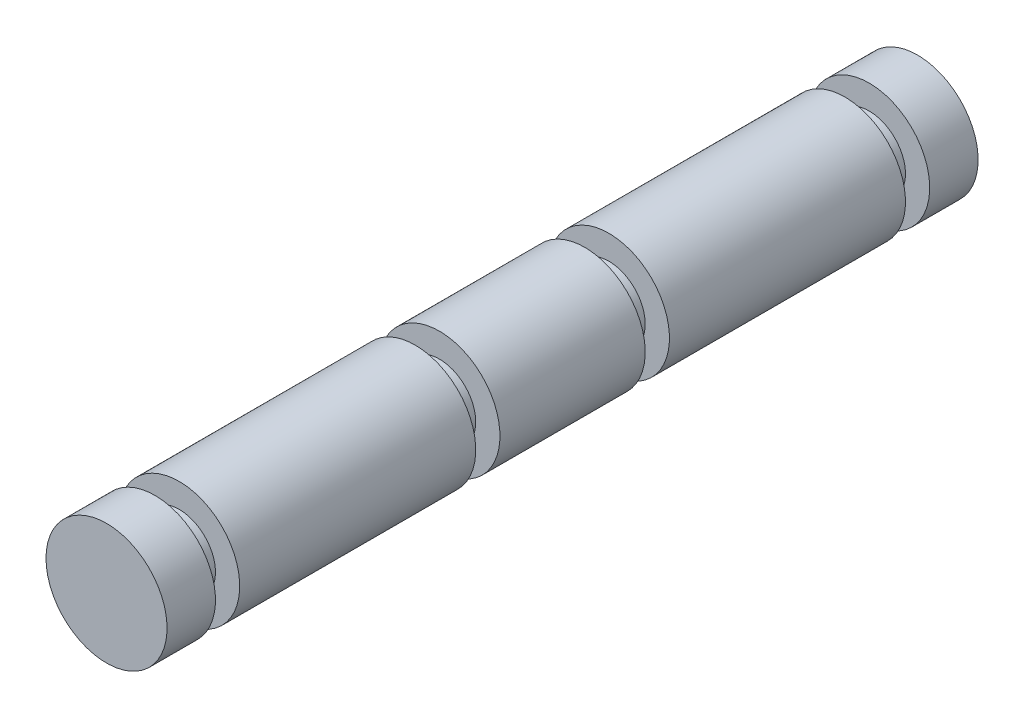
ISO-10303-21;
HEADER;
FILE_DESCRIPTION(('STEP AP214'),'2;1');
FILE_NAME('part.step','',(''),(''),'','','');
FILE_SCHEMA(('AUTOMOTIVE_DESIGN { 1 0 10303 214 1 1 1 1 }'));
ENDSEC;
DATA;
#1=APPLICATION_CONTEXT('core data for automotive mechanical design processes');
#2=APPLICATION_PROTOCOL_DEFINITION('international standard','automotive_design',2000,#1);
#3=PRODUCT_CONTEXT('',#1,'mechanical');
#4=PRODUCT('Part','Part','',(#3));
#5=PRODUCT_RELATED_PRODUCT_CATEGORY('part','',(#4));
#6=PRODUCT_DEFINITION_FORMATION('','',#4);
#7=PRODUCT_DEFINITION_CONTEXT('part definition',#1,'design');
#8=PRODUCT_DEFINITION('design','',#6,#7);
#9=PRODUCT_DEFINITION_SHAPE('','',#8);
#10=(LENGTH_UNIT() NAMED_UNIT(*) SI_UNIT(.MILLI.,.METRE.));
#11=(NAMED_UNIT(*) PLANE_ANGLE_UNIT() SI_UNIT($,.RADIAN.));
#12=(NAMED_UNIT(*) SI_UNIT($,.STERADIAN.) SOLID_ANGLE_UNIT());
#13=UNCERTAINTY_MEASURE_WITH_UNIT(LENGTH_MEASURE(1.E-05),#10,'distance_accuracy_value','');
#14=(GEOMETRIC_REPRESENTATION_CONTEXT(3) GLOBAL_UNCERTAINTY_ASSIGNED_CONTEXT((#13)) GLOBAL_UNIT_ASSIGNED_CONTEXT((#10,
#11,#12)) REPRESENTATION_CONTEXT('',''));
#15=CARTESIAN_POINT('',(0.,0.,0.));
#16=DIRECTION('',(0.,0.,1.));
#17=DIRECTION('',(1.,0.,0.));
#18=AXIS2_PLACEMENT_3D('',#15,#16,#17);
#19=CARTESIAN_POINT('',(0.,0.,-41.5));
#20=DIRECTION('',(0.,0.,1.));
#21=DIRECTION('',(1.,0.,0.));
#22=AXIS2_PLACEMENT_3D('',#19,#20,#21);
#23=PLANE('',#22);
#24=CARTESIAN_POINT('',(0.,0.,-41.5));
#25=DIRECTION('',(0.,0.,-1.));
#26=DIRECTION('',(-1.,0.,0.));
#27=AXIS2_PLACEMENT_3D('',#24,#25,#26);
#28=CIRCLE('',#27,3.00000000000001);
#29=CARTESIAN_POINT('',(-3.,0.,-41.5));
#30=VERTEX_POINT('',#29);
#31=EDGE_CURVE('E10',#30,#30,#28,.T.);
#32=ORIENTED_EDGE('',*,*,#31,.T.);
#33=EDGE_LOOP('',(#32));
#34=FACE_BOUND('',#33,.T.);
#35=CARTESIAN_POINT('',(0.,0.,-41.5));
#36=DIRECTION('',(0.,0.,-1.));
#37=DIRECTION('',(-1.,0.,0.));
#38=AXIS2_PLACEMENT_3D('',#35,#36,#37);
#39=CIRCLE('',#38,5.00000000000001);
#40=CARTESIAN_POINT('',(-5.00000000000001,0.,-41.5));
#41=VERTEX_POINT('',#40);
#42=EDGE_CURVE('E90',#41,#41,#39,.T.);
#43=ORIENTED_EDGE('',*,*,#42,.F.);
#44=EDGE_LOOP('',(#43));
#45=FACE_BOUND('',#44,.T.);
#46=ADVANCED_FACE('F32',(#34,#45),#23,.T.);
#47=CARTESIAN_POINT('',(0.,0.,-67.));
#48=DIRECTION('',(0.,0.,-1.));
#49=DIRECTION('',(-1.,0.,0.));
#50=AXIS2_PLACEMENT_3D('',#47,#48,#49);
#51=CYLINDRICAL_SURFACE('',#50,3.00000000000001);
#52=CARTESIAN_POINT('',(0.,0.,-39.5));
#53=DIRECTION('',(0.,0.,-1.));
#54=DIRECTION('',(-1.,0.,0.));
#55=AXIS2_PLACEMENT_3D('',#52,#53,#54);
#56=CIRCLE('',#55,3.00000000000001);
#57=CARTESIAN_POINT('',(-3.,0.,-39.5));
#58=VERTEX_POINT('',#57);
#59=EDGE_CURVE('E38',#58,#58,#56,.T.);
#60=ORIENTED_EDGE('',*,*,#59,.T.);
#61=EDGE_LOOP('',(#60));
#62=FACE_BOUND('',#61,.T.);
#63=ORIENTED_EDGE('',*,*,#31,.F.);
#64=EDGE_LOOP('',(#63));
#65=FACE_BOUND('',#64,.T.);
#66=ADVANCED_FACE('F98',(#62,#65),#51,.T.);
#67=CARTESIAN_POINT('',(0.,0.,-39.5));
#68=DIRECTION('',(0.,0.,1.));
#69=DIRECTION('',(1.,0.,0.));
#70=AXIS2_PLACEMENT_3D('',#67,#68,#69);
#71=PLANE('',#70);
#72=ORIENTED_EDGE('',*,*,#59,.F.);
#73=EDGE_LOOP('',(#72));
#74=FACE_BOUND('',#73,.T.);
#75=CARTESIAN_POINT('',(0.,0.,-39.5));
#76=DIRECTION('',(0.,0.,-1.));
#77=DIRECTION('',(-1.,0.,0.));
#78=AXIS2_PLACEMENT_3D('',#75,#76,#77);
#79=CIRCLE('',#78,5.00000000000001);
#80=CARTESIAN_POINT('',(-5.,0.,-39.5));
#81=VERTEX_POINT('',#80);
#82=EDGE_CURVE('E42',#81,#81,#79,.T.);
#83=ORIENTED_EDGE('',*,*,#82,.T.);
#84=EDGE_LOOP('',(#83));
#85=FACE_BOUND('',#84,.T.);
#86=ADVANCED_FACE('F102',(#74,#85),#71,.F.);
#87=CARTESIAN_POINT('',(0.,0.,-67.));
#88=DIRECTION('',(0.,0.,-1.));
#89=DIRECTION('',(-1.,0.,0.));
#90=AXIS2_PLACEMENT_3D('',#87,#88,#89);
#91=CYLINDRICAL_SURFACE('',#90,5.00000000000001);
#92=CARTESIAN_POINT('',(0.,0.,-27.5));
#93=DIRECTION('',(0.,0.,-1.));
#94=DIRECTION('',(-1.,0.,0.));
#95=AXIS2_PLACEMENT_3D('',#92,#93,#94);
#96=CIRCLE('',#95,5.00000000000002);
#97=CARTESIAN_POINT('',(-5.,0.,-27.5));
#98=VERTEX_POINT('',#97);
#99=EDGE_CURVE('E46',#98,#98,#96,.T.);
#100=ORIENTED_EDGE('',*,*,#99,.T.);
#101=EDGE_LOOP('',(#100));
#102=FACE_BOUND('',#101,.T.);
#103=ORIENTED_EDGE('',*,*,#82,.F.);
#104=EDGE_LOOP('',(#103));
#105=FACE_BOUND('',#104,.T.);
#106=ADVANCED_FACE('F106',(#102,#105),#91,.T.);
#107=CARTESIAN_POINT('',(0.,0.,-27.5));
#108=DIRECTION('',(0.,0.,1.));
#109=DIRECTION('',(1.,0.,0.));
#110=AXIS2_PLACEMENT_3D('',#107,#108,#109);
#111=PLANE('',#110);
#112=CARTESIAN_POINT('',(0.,0.,-27.5));
#113=DIRECTION('',(0.,0.,-1.));
#114=DIRECTION('',(-1.,0.,0.));
#115=AXIS2_PLACEMENT_3D('',#112,#113,#114);
#116=CIRCLE('',#115,3.00000000000001);
#117=CARTESIAN_POINT('',(-3.,0.,-27.5));
#118=VERTEX_POINT('',#117);
#119=EDGE_CURVE('E51',#118,#118,#116,.T.);
#120=ORIENTED_EDGE('',*,*,#119,.T.);
#121=EDGE_LOOP('',(#120));
#122=FACE_BOUND('',#121,.T.);
#123=ORIENTED_EDGE('',*,*,#99,.F.);
#124=EDGE_LOOP('',(#123));
#125=FACE_BOUND('',#124,.T.);
#126=ADVANCED_FACE('F111',(#122,#125),#111,.T.);
#127=CARTESIAN_POINT('',(0.,0.,-67.));
#128=DIRECTION('',(0.,0.,-1.));
#129=DIRECTION('',(-1.,0.,0.));
#130=AXIS2_PLACEMENT_3D('',#127,#128,#129);
#131=CYLINDRICAL_SURFACE('',#130,3.00000000000001);
#132=ORIENTED_EDGE('',*,*,#119,.F.);
#133=EDGE_LOOP('',(#132));
#134=FACE_BOUND('',#133,.T.);
#135=CARTESIAN_POINT('',(0.,0.,-25.5));
#136=DIRECTION('',(0.,0.,-1.));
#137=DIRECTION('',(-1.,0.,0.));
#138=AXIS2_PLACEMENT_3D('',#135,#136,#137);
#139=CIRCLE('',#138,3.00000000000001);
#140=CARTESIAN_POINT('',(-3.,0.,-25.5));
#141=VERTEX_POINT('',#140);
#142=EDGE_CURVE('E54',#141,#141,#139,.T.);
#143=ORIENTED_EDGE('',*,*,#142,.T.);
#144=EDGE_LOOP('',(#143));
#145=FACE_BOUND('',#144,.T.);
#146=ADVANCED_FACE('F114',(#134,#145),#131,.T.);
#147=CARTESIAN_POINT('',(1.76941794549634E-13,0.,-25.5));
#148=DIRECTION('',(0.,0.,1.));
#149=DIRECTION('',(1.,0.,0.));
#150=AXIS2_PLACEMENT_3D('',#147,#148,#149);
#151=PLANE('',#150);
#152=ORIENTED_EDGE('',*,*,#142,.F.);
#153=EDGE_LOOP('',(#152));
#154=FACE_BOUND('',#153,.T.);
#155=CARTESIAN_POINT('',(0.,0.,-25.5));
#156=DIRECTION('',(0.,0.,-1.));
#157=DIRECTION('',(-1.,0.,0.));
#158=AXIS2_PLACEMENT_3D('',#155,#156,#157);
#159=CIRCLE('',#158,5.00000000000002);
#160=CARTESIAN_POINT('',(-5.,0.,-25.5));
#161=VERTEX_POINT('',#160);
#162=EDGE_CURVE('E57',#161,#161,#159,.T.);
#163=ORIENTED_EDGE('',*,*,#162,.T.);
#164=EDGE_LOOP('',(#163));
#165=FACE_BOUND('',#164,.T.);
#166=ADVANCED_FACE('F118',(#154,#165),#151,.F.);
#167=CARTESIAN_POINT('',(0.,0.,-6.));
#168=DIRECTION('',(0.,0.,-1.));
#169=DIRECTION('',(-1.,0.,0.));
#170=AXIS2_PLACEMENT_3D('',#167,#168,#169);
#171=CIRCLE('',#170,5.00000000000002);
#172=CARTESIAN_POINT('',(-5.,0.,-6.));
#173=VERTEX_POINT('',#172);
#174=EDGE_CURVE('E60',#173,#173,#171,.T.);
#175=ORIENTED_EDGE('',*,*,#174,.T.);
#176=EDGE_LOOP('',(#175));
#177=FACE_BOUND('',#176,.T.);
#178=ORIENTED_EDGE('',*,*,#162,.F.);
#179=EDGE_LOOP('',(#178));
#180=FACE_BOUND('',#179,.T.);
#181=ADVANCED_FACE('F122',(#177,#180),#91,.T.);
#182=CARTESIAN_POINT('',(0.,0.,-6.));
#183=DIRECTION('',(0.,0.,1.));
#184=DIRECTION('',(1.,0.,0.));
#185=AXIS2_PLACEMENT_3D('',#182,#183,#184);
#186=PLANE('',#185);
#187=CARTESIAN_POINT('',(0.,0.,-6.));
#188=DIRECTION('',(0.,0.,-1.));
#189=DIRECTION('',(-1.,0.,0.));
#190=AXIS2_PLACEMENT_3D('',#187,#188,#189);
#191=CIRCLE('',#190,3.00000000000002);
#192=CARTESIAN_POINT('',(-3.,0.,-6.));
#193=VERTEX_POINT('',#192);
#194=EDGE_CURVE('E63',#193,#193,#191,.T.);
#195=ORIENTED_EDGE('',*,*,#194,.T.);
#196=EDGE_LOOP('',(#195));
#197=FACE_BOUND('',#196,.T.);
#198=ORIENTED_EDGE('',*,*,#174,.F.);
#199=EDGE_LOOP('',(#198));
#200=FACE_BOUND('',#199,.T.);
#201=ADVANCED_FACE('F124',(#197,#200),#186,.T.);
#202=CARTESIAN_POINT('',(0.,0.,-67.));
#203=DIRECTION('',(0.,0.,-1.));
#204=DIRECTION('',(-1.,0.,0.));
#205=AXIS2_PLACEMENT_3D('',#202,#203,#204);
#206=CYLINDRICAL_SURFACE('',#205,3.00000000000002);
#207=CARTESIAN_POINT('',(0.,0.,-4.));
#208=DIRECTION('',(0.,0.,-1.));
#209=DIRECTION('',(-1.,0.,0.));
#210=AXIS2_PLACEMENT_3D('',#207,#208,#209);
#211=CIRCLE('',#210,3.00000000000002);
#212=CARTESIAN_POINT('',(-3.,0.,-4.));
#213=VERTEX_POINT('',#212);
#214=EDGE_CURVE('E66',#213,#213,#211,.T.);
#215=ORIENTED_EDGE('',*,*,#214,.T.);
#216=EDGE_LOOP('',(#215));
#217=FACE_BOUND('',#216,.T.);
#218=ORIENTED_EDGE('',*,*,#194,.F.);
#219=EDGE_LOOP('',(#218));
#220=FACE_BOUND('',#219,.T.);
#221=ADVANCED_FACE('F127',(#217,#220),#206,.T.);
#222=CARTESIAN_POINT('',(0.,0.,-4.));
#223=DIRECTION('',(0.,0.,1.));
#224=DIRECTION('',(1.,0.,0.));
#225=AXIS2_PLACEMENT_3D('',#222,#223,#224);
#226=PLANE('',#225);
#227=ORIENTED_EDGE('',*,*,#214,.F.);
#228=EDGE_LOOP('',(#227));
#229=FACE_BOUND('',#228,.T.);
#230=CARTESIAN_POINT('',(0.,0.,-4.));
#231=DIRECTION('',(0.,0.,-1.));
#232=DIRECTION('',(-1.,0.,0.));
#233=AXIS2_PLACEMENT_3D('',#230,#231,#232);
#234=CIRCLE('',#233,5.00000000000002);
#235=CARTESIAN_POINT('',(-5.,0.,-4.));
#236=VERTEX_POINT('',#235);
#237=EDGE_CURVE('E69',#236,#236,#234,.T.);
#238=ORIENTED_EDGE('',*,*,#237,.T.);
#239=EDGE_LOOP('',(#238));
#240=FACE_BOUND('',#239,.T.);
#241=ADVANCED_FACE('F131',(#229,#240),#226,.F.);
#242=CARTESIAN_POINT('',(0.,0.,0.));
#243=DIRECTION('',(0.,0.,-1.));
#244=DIRECTION('',(-1.,0.,0.));
#245=AXIS2_PLACEMENT_3D('',#242,#243,#244);
#246=CIRCLE('',#245,5.00000000000002);
#247=CARTESIAN_POINT('',(-5.,0.,0.));
#248=VERTEX_POINT('',#247);
#249=EDGE_CURVE('E72',#248,#248,#246,.T.);
#250=ORIENTED_EDGE('',*,*,#249,.T.);
#251=EDGE_LOOP('',(#250));
#252=FACE_BOUND('',#251,.T.);
#253=ORIENTED_EDGE('',*,*,#237,.F.);
#254=EDGE_LOOP('',(#253));
#255=FACE_BOUND('',#254,.T.);
#256=ADVANCED_FACE('F135',(#252,#255),#91,.T.);
#257=CARTESIAN_POINT('',(0.,0.,0.));
#258=DIRECTION('',(0.,0.,-1.));
#259=DIRECTION('',(-1.,0.,0.));
#260=AXIS2_PLACEMENT_3D('',#257,#258,#259);
#261=PLANE('',#260);
#262=ORIENTED_EDGE('',*,*,#249,.F.);
#263=EDGE_LOOP('',(#262));
#264=FACE_BOUND('',#263,.T.);
#265=ADVANCED_FACE('F137',(#264),#261,.F.);
#266=CARTESIAN_POINT('',(0.,0.,-67.));
#267=DIRECTION('',(0.,0.,-1.));
#268=DIRECTION('',(-1.,0.,0.));
#269=AXIS2_PLACEMENT_3D('',#266,#267,#268);
#270=PLANE('',#269);
#271=CARTESIAN_POINT('',(0.,0.,-67.));
#272=DIRECTION('',(0.,0.,-1.));
#273=DIRECTION('',(-1.,0.,0.));
#274=AXIS2_PLACEMENT_3D('',#271,#272,#273);
#275=CIRCLE('',#274,5.);
#276=CARTESIAN_POINT('',(-5.00000000000001,0.,-67.));
#277=VERTEX_POINT('',#276);
#278=EDGE_CURVE('E75',#277,#277,#275,.T.);
#279=ORIENTED_EDGE('',*,*,#278,.T.);
#280=EDGE_LOOP('',(#279));
#281=FACE_BOUND('',#280,.T.);
#282=ADVANCED_FACE('F140',(#281),#270,.T.);
#283=CARTESIAN_POINT('',(0.,0.,-63.));
#284=DIRECTION('',(0.,0.,-1.));
#285=DIRECTION('',(-1.,0.,0.));
#286=AXIS2_PLACEMENT_3D('',#283,#284,#285);
#287=CIRCLE('',#286,5.);
#288=CARTESIAN_POINT('',(-5.00000000000001,0.,-63.));
#289=VERTEX_POINT('',#288);
#290=EDGE_CURVE('E78',#289,#289,#287,.T.);
#291=ORIENTED_EDGE('',*,*,#290,.T.);
#292=EDGE_LOOP('',(#291));
#293=FACE_BOUND('',#292,.T.);
#294=ORIENTED_EDGE('',*,*,#278,.F.);
#295=EDGE_LOOP('',(#294));
#296=FACE_BOUND('',#295,.T.);
#297=ADVANCED_FACE('F144',(#293,#296),#91,.T.);
#298=CARTESIAN_POINT('',(0.,0.,-63.));
#299=DIRECTION('',(0.,0.,1.));
#300=DIRECTION('',(1.,0.,0.));
#301=AXIS2_PLACEMENT_3D('',#298,#299,#300);
#302=PLANE('',#301);
#303=CARTESIAN_POINT('',(0.,0.,-63.));
#304=DIRECTION('',(0.,0.,-1.));
#305=DIRECTION('',(-1.,0.,0.));
#306=AXIS2_PLACEMENT_3D('',#303,#304,#305);
#307=CIRCLE('',#306,3.);
#308=CARTESIAN_POINT('',(-3.00000000000001,0.,-63.));
#309=VERTEX_POINT('',#308);
#310=EDGE_CURVE('E81',#309,#309,#307,.T.);
#311=ORIENTED_EDGE('',*,*,#310,.T.);
#312=EDGE_LOOP('',(#311));
#313=FACE_BOUND('',#312,.T.);
#314=ORIENTED_EDGE('',*,*,#290,.F.);
#315=EDGE_LOOP('',(#314));
#316=FACE_BOUND('',#315,.T.);
#317=ADVANCED_FACE('F146',(#313,#316),#302,.T.);
#318=CARTESIAN_POINT('',(0.,0.,-67.));
#319=DIRECTION('',(0.,0.,-1.));
#320=DIRECTION('',(-1.,0.,0.));
#321=AXIS2_PLACEMENT_3D('',#318,#319,#320);
#322=CYLINDRICAL_SURFACE('',#321,3.);
#323=CARTESIAN_POINT('',(0.,0.,-61.));
#324=DIRECTION('',(0.,0.,-1.));
#325=DIRECTION('',(-1.,0.,0.));
#326=AXIS2_PLACEMENT_3D('',#323,#324,#325);
#327=CIRCLE('',#326,3.);
#328=CARTESIAN_POINT('',(-3.00000000000001,0.,-61.));
#329=VERTEX_POINT('',#328);
#330=EDGE_CURVE('E84',#329,#329,#327,.T.);
#331=ORIENTED_EDGE('',*,*,#330,.T.);
#332=EDGE_LOOP('',(#331));
#333=FACE_BOUND('',#332,.T.);
#334=ORIENTED_EDGE('',*,*,#310,.F.);
#335=EDGE_LOOP('',(#334));
#336=FACE_BOUND('',#335,.T.);
#337=ADVANCED_FACE('F149',(#333,#336),#322,.T.);
#338=CARTESIAN_POINT('',(0.,0.,-61.));
#339=DIRECTION('',(0.,0.,1.));
#340=DIRECTION('',(1.,0.,0.));
#341=AXIS2_PLACEMENT_3D('',#338,#339,#340);
#342=PLANE('',#341);
#343=ORIENTED_EDGE('',*,*,#330,.F.);
#344=EDGE_LOOP('',(#343));
#345=FACE_BOUND('',#344,.T.);
#346=CARTESIAN_POINT('',(0.,0.,-61.));
#347=DIRECTION('',(0.,0.,-1.));
#348=DIRECTION('',(-1.,0.,0.));
#349=AXIS2_PLACEMENT_3D('',#346,#347,#348);
#350=CIRCLE('',#349,5.);
#351=CARTESIAN_POINT('',(-5.00000000000001,0.,-61.));
#352=VERTEX_POINT('',#351);
#353=EDGE_CURVE('E87',#352,#352,#350,.T.);
#354=ORIENTED_EDGE('',*,*,#353,.T.);
#355=EDGE_LOOP('',(#354));
#356=FACE_BOUND('',#355,.T.);
#357=ADVANCED_FACE('F153',(#345,#356),#342,.F.);
#358=ORIENTED_EDGE('',*,*,#42,.T.);
#359=EDGE_LOOP('',(#358));
#360=FACE_BOUND('',#359,.T.);
#361=ORIENTED_EDGE('',*,*,#353,.F.);
#362=EDGE_LOOP('',(#361));
#363=FACE_BOUND('',#362,.T.);
#364=ADVANCED_FACE('F94',(#360,#363),#91,.T.);
#365=CLOSED_SHELL('',(#46,#66,#86,#106,#126,#146,#166,#181,#201,#221,#241,#256,#265,#282,#297,
#317,#337,#357,#364));
#366=MANIFOLD_SOLID_BREP('B2',#365);
#367=ADVANCED_BREP_SHAPE_REPRESENTATION('',(#18,#366),#14);
#368=SHAPE_DEFINITION_REPRESENTATION(#9,#367);
ENDSEC;
END-ISO-10303-21;
